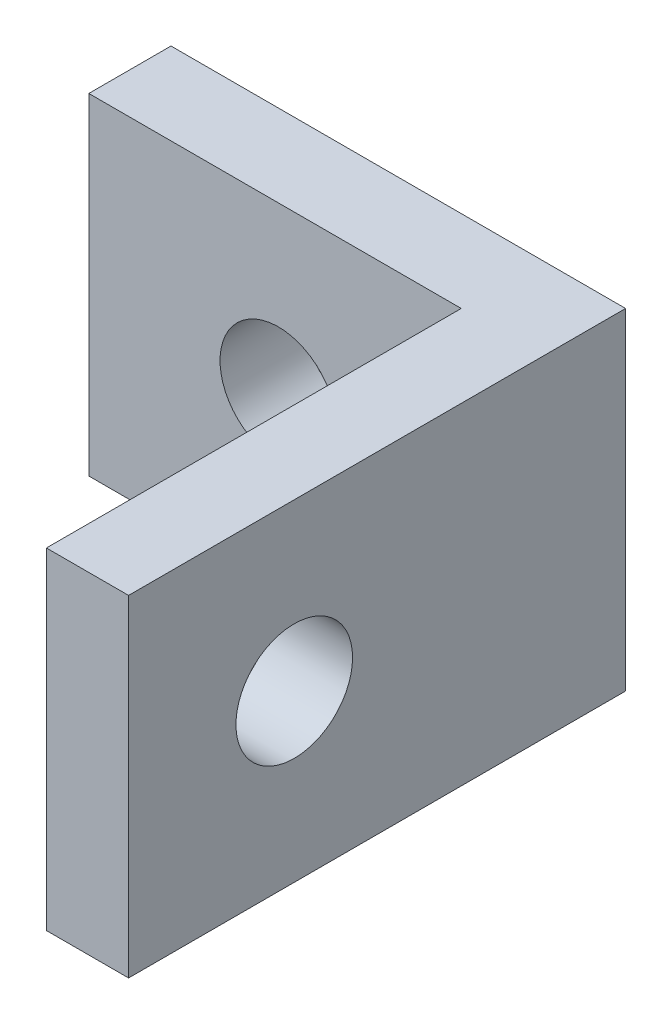
ISO-10303-21;
HEADER;
FILE_DESCRIPTION(('STEP AP214'),'2;1');
FILE_NAME('part.step','',(''),(''),'','','');
FILE_SCHEMA(('AUTOMOTIVE_DESIGN { 1 0 10303 214 1 1 1 1 }'));
ENDSEC;
DATA;
#1=APPLICATION_CONTEXT('core data for automotive mechanical design processes');
#2=APPLICATION_PROTOCOL_DEFINITION('international standard','automotive_design',2000,#1);
#3=PRODUCT_CONTEXT('',#1,'mechanical');
#4=PRODUCT('Part','Part','',(#3));
#5=PRODUCT_RELATED_PRODUCT_CATEGORY('part','',(#4));
#6=PRODUCT_DEFINITION_FORMATION('','',#4);
#7=PRODUCT_DEFINITION_CONTEXT('part definition',#1,'design');
#8=PRODUCT_DEFINITION('design','',#6,#7);
#9=PRODUCT_DEFINITION_SHAPE('','',#8);
#10=(LENGTH_UNIT() NAMED_UNIT(*) SI_UNIT(.MILLI.,.METRE.));
#11=(NAMED_UNIT(*) PLANE_ANGLE_UNIT() SI_UNIT($,.RADIAN.));
#12=(NAMED_UNIT(*) SI_UNIT($,.STERADIAN.) SOLID_ANGLE_UNIT());
#13=UNCERTAINTY_MEASURE_WITH_UNIT(LENGTH_MEASURE(1.E-05),#10,'distance_accuracy_value','');
#14=(GEOMETRIC_REPRESENTATION_CONTEXT(3) GLOBAL_UNCERTAINTY_ASSIGNED_CONTEXT((#13)) GLOBAL_UNIT_ASSIGNED_CONTEXT((#10,
#11,#12)) REPRESENTATION_CONTEXT('',''));
#15=CARTESIAN_POINT('',(0.,0.,0.));
#16=DIRECTION('',(0.,0.,1.));
#17=DIRECTION('',(1.,0.,0.));
#18=AXIS2_PLACEMENT_3D('',#15,#16,#17);
#19=CARTESIAN_POINT('',(4.3561,3.175,1.5748));
#20=DIRECTION('',(0.,0.,-1.));
#21=DIRECTION('',(-1.,0.,0.));
#22=AXIS2_PLACEMENT_3D('',#19,#20,#21);
#23=PLANE('',#22);
#24=CARTESIAN_POINT('',(-0.7239,0.,1.5748));
#25=DIRECTION('',(0.,0.,1.));
#26=DIRECTION('',(1.,0.,0.));
#27=AXIS2_PLACEMENT_3D('',#24,#25,#26);
#28=CIRCLE('',#27,1.1176);
#29=CARTESIAN_POINT('',(0.393699999999999,0.,1.5748));
#30=VERTEX_POINT('',#29);
#31=EDGE_CURVE('E148',#30,#30,#28,.T.);
#32=ORIENTED_EDGE('',*,*,#31,.F.);
#33=EDGE_LOOP('',(#32));
#34=FACE_BOUND('',#33,.T.);
#35=DIRECTION('',(0.,-1.,0.));
#36=VECTOR('',#35,1.);
#37=CARTESIAN_POINT('',(2.7813,-3.175,1.5748));
#38=LINE('',#37,#36);
#39=CARTESIAN_POINT('',(2.7813,3.175,1.5748));
#40=VERTEX_POINT('',#39);
#41=CARTESIAN_POINT('',(2.7813,-3.175,1.5748));
#42=VERTEX_POINT('',#41);
#43=EDGE_CURVE('E50',#40,#42,#38,.T.);
#44=ORIENTED_EDGE('',*,*,#43,.F.);
#45=DIRECTION('',(-1.,0.,0.));
#46=VECTOR('',#45,1.);
#47=CARTESIAN_POINT('',(-4.3561,3.175,1.5748));
#48=LINE('',#47,#46);
#49=CARTESIAN_POINT('',(-4.3561,3.175,1.5748));
#50=VERTEX_POINT('',#49);
#51=EDGE_CURVE('E88',#40,#50,#48,.T.);
#52=ORIENTED_EDGE('',*,*,#51,.T.);
#53=DIRECTION('',(0.,-1.,0.));
#54=VECTOR('',#53,1.);
#55=CARTESIAN_POINT('',(-4.3561,-3.175,1.5748));
#56=LINE('',#55,#54);
#57=CARTESIAN_POINT('',(-4.3561,-3.175,1.5748));
#58=VERTEX_POINT('',#57);
#59=EDGE_CURVE('E56',#50,#58,#56,.T.);
#60=ORIENTED_EDGE('',*,*,#59,.T.);
#61=DIRECTION('',(1.,0.,0.));
#62=VECTOR('',#61,1.);
#63=CARTESIAN_POINT('',(-4.3561,-3.175,1.5748));
#64=LINE('',#63,#62);
#65=EDGE_CURVE('E98',#58,#42,#64,.T.);
#66=ORIENTED_EDGE('',*,*,#65,.T.);
#67=EDGE_LOOP('',(#44,#52,#60,#66));
#68=FACE_BOUND('',#67,.T.);
#69=ADVANCED_FACE('F33',(#34,#68),#23,.F.);
#70=CARTESIAN_POINT('',(4.3561,-3.175,1.5748));
#71=DIRECTION('',(-1.,0.,0.));
#72=DIRECTION('',(0.,0.,1.));
#73=AXIS2_PLACEMENT_3D('',#70,#71,#72);
#74=PLANE('',#73);
#75=CARTESIAN_POINT('',(4.3561,0.,6.35));
#76=DIRECTION('',(1.,0.,0.));
#77=DIRECTION('',(0.,0.,-1.));
#78=AXIS2_PLACEMENT_3D('',#75,#76,#77);
#79=CIRCLE('',#78,1.1176);
#80=CARTESIAN_POINT('',(4.3561,0.,5.2324));
#81=VERTEX_POINT('',#80);
#82=EDGE_CURVE('E153',#81,#81,#79,.T.);
#83=ORIENTED_EDGE('',*,*,#82,.F.);
#84=EDGE_LOOP('',(#83));
#85=FACE_BOUND('',#84,.T.);
#86=DIRECTION('',(0.,1.,0.));
#87=VECTOR('',#86,1.);
#88=CARTESIAN_POINT('',(4.3561,-3.175,0.));
#89=LINE('',#88,#87);
#90=CARTESIAN_POINT('',(4.3561,-3.175,0.));
#91=VERTEX_POINT('',#90);
#92=CARTESIAN_POINT('',(4.3561,3.175,0.));
#93=VERTEX_POINT('',#92);
#94=EDGE_CURVE('E95',#91,#93,#89,.T.);
#95=ORIENTED_EDGE('',*,*,#94,.T.);
#96=DIRECTION('',(0.,0.,-1.));
#97=VECTOR('',#96,1.);
#98=CARTESIAN_POINT('',(4.3561,3.175,1.5748));
#99=LINE('',#98,#97);
#100=CARTESIAN_POINT('',(4.3561,3.175,9.525));
#101=VERTEX_POINT('',#100);
#102=EDGE_CURVE('E11',#101,#93,#99,.T.);
#103=ORIENTED_EDGE('',*,*,#102,.F.);
#104=DIRECTION('',(0.,1.,0.));
#105=VECTOR('',#104,1.);
#106=CARTESIAN_POINT('',(4.3561,3.175,9.525));
#107=LINE('',#106,#105);
#108=CARTESIAN_POINT('',(4.3561,-3.175,9.525));
#109=VERTEX_POINT('',#108);
#110=EDGE_CURVE('E97',#109,#101,#107,.T.);
#111=ORIENTED_EDGE('',*,*,#110,.F.);
#112=DIRECTION('',(0.,0.,-1.));
#113=VECTOR('',#112,1.);
#114=CARTESIAN_POINT('',(4.3561,-3.175,1.5748));
#115=LINE('',#114,#113);
#116=EDGE_CURVE('E81',#109,#91,#115,.T.);
#117=ORIENTED_EDGE('',*,*,#116,.T.);
#118=EDGE_LOOP('',(#95,#103,#111,#117));
#119=FACE_BOUND('',#118,.T.);
#120=ADVANCED_FACE('F35',(#85,#119),#74,.F.);
#121=CARTESIAN_POINT('',(-4.3561,3.175,1.5748));
#122=DIRECTION('',(0.,-1.,0.));
#123=DIRECTION('',(0.,0.,-1.));
#124=AXIS2_PLACEMENT_3D('',#121,#122,#123);
#125=PLANE('',#124);
#126=DIRECTION('',(-1.,0.,0.));
#127=VECTOR('',#126,1.);
#128=CARTESIAN_POINT('',(-4.3561,3.175,0.));
#129=LINE('',#128,#127);
#130=CARTESIAN_POINT('',(-4.3561,3.175,0.));
#131=VERTEX_POINT('',#130);
#132=EDGE_CURVE('E101',#93,#131,#129,.T.);
#133=ORIENTED_EDGE('',*,*,#132,.T.);
#134=DIRECTION('',(0.,0.,-1.));
#135=VECTOR('',#134,1.);
#136=CARTESIAN_POINT('',(-4.3561,3.175,1.5748));
#137=LINE('',#136,#135);
#138=EDGE_CURVE('E42',#50,#131,#137,.T.);
#139=ORIENTED_EDGE('',*,*,#138,.F.);
#140=ORIENTED_EDGE('',*,*,#51,.F.);
#141=DIRECTION('',(0.,0.,-1.));
#142=VECTOR('',#141,1.);
#143=CARTESIAN_POINT('',(2.7813,3.175,9.525));
#144=LINE('',#143,#142);
#145=CARTESIAN_POINT('',(2.7813,3.175,9.525));
#146=VERTEX_POINT('',#145);
#147=EDGE_CURVE('E102',#146,#40,#144,.T.);
#148=ORIENTED_EDGE('',*,*,#147,.F.);
#149=DIRECTION('',(-1.,0.,0.));
#150=VECTOR('',#149,1.);
#151=CARTESIAN_POINT('',(2.7813,3.175,9.525));
#152=LINE('',#151,#150);
#153=EDGE_CURVE('E132',#101,#146,#152,.T.);
#154=ORIENTED_EDGE('',*,*,#153,.F.);
#155=ORIENTED_EDGE('',*,*,#102,.T.);
#156=EDGE_LOOP('',(#133,#139,#140,#148,#154,#155));
#157=FACE_BOUND('',#156,.T.);
#158=ADVANCED_FACE('F177',(#157),#125,.F.);
#159=CARTESIAN_POINT('',(-4.3561,-3.175,1.5748));
#160=DIRECTION('',(1.,0.,0.));
#161=DIRECTION('',(0.,0.,-1.));
#162=AXIS2_PLACEMENT_3D('',#159,#160,#161);
#163=PLANE('',#162);
#164=DIRECTION('',(0.,-1.,0.));
#165=VECTOR('',#164,1.);
#166=CARTESIAN_POINT('',(-4.3561,-3.175,0.));
#167=LINE('',#166,#165);
#168=CARTESIAN_POINT('',(-4.3561,-3.175,0.));
#169=VERTEX_POINT('',#168);
#170=EDGE_CURVE('E89',#131,#169,#167,.T.);
#171=ORIENTED_EDGE('',*,*,#170,.T.);
#172=DIRECTION('',(0.,0.,-1.));
#173=VECTOR('',#172,1.);
#174=CARTESIAN_POINT('',(-4.3561,-3.175,1.5748));
#175=LINE('',#174,#173);
#176=EDGE_CURVE('E84',#58,#169,#175,.T.);
#177=ORIENTED_EDGE('',*,*,#176,.F.);
#178=ORIENTED_EDGE('',*,*,#59,.F.);
#179=ORIENTED_EDGE('',*,*,#138,.T.);
#180=EDGE_LOOP('',(#171,#177,#178,#179));
#181=FACE_BOUND('',#180,.T.);
#182=ADVANCED_FACE('F188',(#181),#163,.F.);
#183=CARTESIAN_POINT('',(-4.3561,-3.175,1.5748));
#184=DIRECTION('',(0.,1.,0.));
#185=DIRECTION('',(0.,0.,1.));
#186=AXIS2_PLACEMENT_3D('',#183,#184,#185);
#187=PLANE('',#186);
#188=DIRECTION('',(1.,0.,0.));
#189=VECTOR('',#188,1.);
#190=CARTESIAN_POINT('',(-4.3561,-3.175,0.));
#191=LINE('',#190,#189);
#192=EDGE_CURVE('E76',#169,#91,#191,.T.);
#193=ORIENTED_EDGE('',*,*,#192,.T.);
#194=ORIENTED_EDGE('',*,*,#116,.F.);
#195=DIRECTION('',(1.,0.,0.));
#196=VECTOR('',#195,1.);
#197=CARTESIAN_POINT('',(4.3561,-3.175,9.525));
#198=LINE('',#197,#196);
#199=CARTESIAN_POINT('',(2.7813,-3.175,9.525));
#200=VERTEX_POINT('',#199);
#201=EDGE_CURVE('E134',#200,#109,#198,.T.);
#202=ORIENTED_EDGE('',*,*,#201,.F.);
#203=DIRECTION('',(0.,0.,-1.));
#204=VECTOR('',#203,1.);
#205=CARTESIAN_POINT('',(2.7813,-3.175,9.525));
#206=LINE('',#205,#204);
#207=EDGE_CURVE('E106',#200,#42,#206,.T.);
#208=ORIENTED_EDGE('',*,*,#207,.T.);
#209=ORIENTED_EDGE('',*,*,#65,.F.);
#210=ORIENTED_EDGE('',*,*,#176,.T.);
#211=EDGE_LOOP('',(#193,#194,#202,#208,#209,#210));
#212=FACE_BOUND('',#211,.T.);
#213=ADVANCED_FACE('F78',(#212),#187,.F.);
#214=CARTESIAN_POINT('',(4.3561,3.175,0.));
#215=DIRECTION('',(0.,0.,-1.));
#216=DIRECTION('',(-1.,0.,0.));
#217=AXIS2_PLACEMENT_3D('',#214,#215,#216);
#218=PLANE('',#217);
#219=CARTESIAN_POINT('',(-0.7239,0.,0.));
#220=DIRECTION('',(0.,0.,1.));
#221=DIRECTION('',(1.,0.,0.));
#222=AXIS2_PLACEMENT_3D('',#219,#220,#221);
#223=CIRCLE('',#222,1.1176);
#224=CARTESIAN_POINT('',(0.393699999999999,0.,0.));
#225=VERTEX_POINT('',#224);
#226=EDGE_CURVE('E133',#225,#225,#223,.T.);
#227=ORIENTED_EDGE('',*,*,#226,.T.);
#228=EDGE_LOOP('',(#227));
#229=FACE_BOUND('',#228,.T.);
#230=ORIENTED_EDGE('',*,*,#94,.F.);
#231=ORIENTED_EDGE('',*,*,#192,.F.);
#232=ORIENTED_EDGE('',*,*,#170,.F.);
#233=ORIENTED_EDGE('',*,*,#132,.F.);
#234=EDGE_LOOP('',(#230,#231,#232,#233));
#235=FACE_BOUND('',#234,.T.);
#236=ADVANCED_FACE('F100',(#229,#235),#218,.T.);
#237=CARTESIAN_POINT('',(2.7813,-3.175,9.525));
#238=DIRECTION('',(1.,0.,0.));
#239=DIRECTION('',(0.,0.,-1.));
#240=AXIS2_PLACEMENT_3D('',#237,#238,#239);
#241=PLANE('',#240);
#242=CARTESIAN_POINT('',(2.7813,0.,6.35));
#243=DIRECTION('',(1.,0.,0.));
#244=DIRECTION('',(0.,0.,-1.));
#245=AXIS2_PLACEMENT_3D('',#242,#243,#244);
#246=CIRCLE('',#245,1.1176);
#247=CARTESIAN_POINT('',(2.7813,0.,5.2324));
#248=VERTEX_POINT('',#247);
#249=EDGE_CURVE('E37',#248,#248,#246,.T.);
#250=ORIENTED_EDGE('',*,*,#249,.T.);
#251=EDGE_LOOP('',(#250));
#252=FACE_BOUND('',#251,.T.);
#253=ORIENTED_EDGE('',*,*,#43,.T.);
#254=ORIENTED_EDGE('',*,*,#207,.F.);
#255=DIRECTION('',(0.,-1.,0.));
#256=VECTOR('',#255,1.);
#257=CARTESIAN_POINT('',(2.7813,-3.175,9.525));
#258=LINE('',#257,#256);
#259=EDGE_CURVE('E142',#146,#200,#258,.T.);
#260=ORIENTED_EDGE('',*,*,#259,.F.);
#261=ORIENTED_EDGE('',*,*,#147,.T.);
#262=EDGE_LOOP('',(#253,#254,#260,#261));
#263=FACE_BOUND('',#262,.T.);
#264=ADVANCED_FACE('F128',(#252,#263),#241,.F.);
#265=CARTESIAN_POINT('',(4.3561,3.175,9.525));
#266=DIRECTION('',(0.,0.,-1.));
#267=DIRECTION('',(-1.,0.,0.));
#268=AXIS2_PLACEMENT_3D('',#265,#266,#267);
#269=PLANE('',#268);
#270=ORIENTED_EDGE('',*,*,#153,.T.);
#271=ORIENTED_EDGE('',*,*,#259,.T.);
#272=ORIENTED_EDGE('',*,*,#201,.T.);
#273=ORIENTED_EDGE('',*,*,#110,.T.);
#274=EDGE_LOOP('',(#270,#271,#272,#273));
#275=FACE_BOUND('',#274,.T.);
#276=ADVANCED_FACE('F168',(#275),#269,.F.);
#277=CARTESIAN_POINT('',(-0.7239,0.,0.));
#278=DIRECTION('',(0.,0.,1.));
#279=DIRECTION('',(1.,0.,0.));
#280=AXIS2_PLACEMENT_3D('',#277,#278,#279);
#281=CYLINDRICAL_SURFACE('',#280,1.1176);
#282=ORIENTED_EDGE('',*,*,#226,.F.);
#283=EDGE_LOOP('',(#282));
#284=FACE_BOUND('',#283,.T.);
#285=ORIENTED_EDGE('',*,*,#31,.T.);
#286=EDGE_LOOP('',(#285));
#287=FACE_BOUND('',#286,.T.);
#288=ADVANCED_FACE('F163',(#284,#287),#281,.F.);
#289=CARTESIAN_POINT('',(-4.356125,0.,6.35));
#290=DIRECTION('',(1.,0.,0.));
#291=DIRECTION('',(0.,0.,-1.));
#292=AXIS2_PLACEMENT_3D('',#289,#290,#291);
#293=CYLINDRICAL_SURFACE('',#292,1.1176);
#294=ORIENTED_EDGE('',*,*,#82,.T.);
#295=EDGE_LOOP('',(#294));
#296=FACE_BOUND('',#295,.T.);
#297=ORIENTED_EDGE('',*,*,#249,.F.);
#298=EDGE_LOOP('',(#297));
#299=FACE_BOUND('',#298,.T.);
#300=ADVANCED_FACE('F161',(#296,#299),#293,.F.);
#301=CLOSED_SHELL('',(#69,#120,#158,#182,#213,#236,#264,#276,#288,#300));
#302=MANIFOLD_SOLID_BREP('B2',#301);
#303=ADVANCED_BREP_SHAPE_REPRESENTATION('',(#18,#302),#14);
#304=SHAPE_DEFINITION_REPRESENTATION(#9,#303);
ENDSEC;
END-ISO-10303-21;
